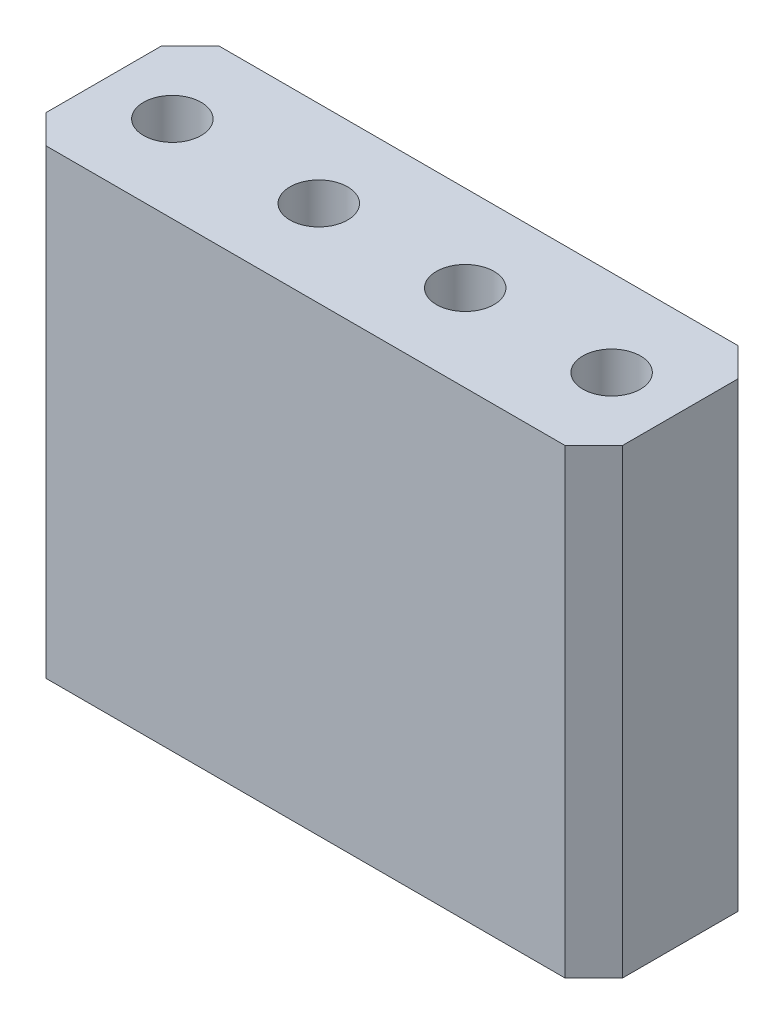
ISO-10303-21;
HEADER;
FILE_DESCRIPTION(('STEP AP214'),'2;1');
FILE_NAME('part.step','',(''),(''),'','','');
FILE_SCHEMA(('AUTOMOTIVE_DESIGN { 1 0 10303 214 1 1 1 1 }'));
ENDSEC;
DATA;
#1=APPLICATION_CONTEXT('core data for automotive mechanical design processes');
#2=APPLICATION_PROTOCOL_DEFINITION('international standard','automotive_design',2000,#1);
#3=PRODUCT_CONTEXT('',#1,'mechanical');
#4=PRODUCT('Part','Part','',(#3));
#5=PRODUCT_RELATED_PRODUCT_CATEGORY('part','',(#4));
#6=PRODUCT_DEFINITION_FORMATION('','',#4);
#7=PRODUCT_DEFINITION_CONTEXT('part definition',#1,'design');
#8=PRODUCT_DEFINITION('design','',#6,#7);
#9=PRODUCT_DEFINITION_SHAPE('','',#8);
#10=(LENGTH_UNIT() NAMED_UNIT(*) SI_UNIT(.MILLI.,.METRE.));
#11=(NAMED_UNIT(*) PLANE_ANGLE_UNIT() SI_UNIT($,.RADIAN.));
#12=(NAMED_UNIT(*) SI_UNIT($,.STERADIAN.) SOLID_ANGLE_UNIT());
#13=UNCERTAINTY_MEASURE_WITH_UNIT(LENGTH_MEASURE(1.E-05),#10,'distance_accuracy_value','');
#14=(GEOMETRIC_REPRESENTATION_CONTEXT(3) GLOBAL_UNCERTAINTY_ASSIGNED_CONTEXT((#13)) GLOBAL_UNIT_ASSIGNED_CONTEXT((#10,
#11,#12)) REPRESENTATION_CONTEXT('',''));
#15=CARTESIAN_POINT('',(0.,0.,0.));
#16=DIRECTION('',(0.,0.,1.));
#17=DIRECTION('',(1.,0.,0.));
#18=AXIS2_PLACEMENT_3D('',#15,#16,#17);
#19=CARTESIAN_POINT('',(0.,6.,0.));
#20=DIRECTION('',(0.,-1.,0.));
#21=DIRECTION('',(0.,0.,-1.));
#22=AXIS2_PLACEMENT_3D('',#19,#20,#21);
#23=PLANE('',#22);
#24=DIRECTION('',(-1.,0.,0.));
#25=VECTOR('',#24,1.);
#26=CARTESIAN_POINT('',(0.949999999999953,6.,-0.319999999999997));
#27=LINE('',#26,#25);
#28=CARTESIAN_POINT('',(1.58999999999995,6.,-0.319999999999997));
#29=VERTEX_POINT('',#28);
#30=CARTESIAN_POINT('',(0.949999999999953,6.,-0.319999999999997));
#31=VERTEX_POINT('',#30);
#32=EDGE_CURVE('E199',#29,#31,#27,.T.);
#33=ORIENTED_EDGE('',*,*,#32,.F.);
#34=DIRECTION('',(0.,0.,-1.));
#35=VECTOR('',#34,1.);
#36=CARTESIAN_POINT('',(1.58999999999995,6.,-0.319999999999997));
#37=LINE('',#36,#35);
#38=CARTESIAN_POINT('',(1.58999999999995,6.,0.320000000000003));
#39=VERTEX_POINT('',#38);
#40=EDGE_CURVE('E225',#39,#29,#37,.T.);
#41=ORIENTED_EDGE('',*,*,#40,.F.);
#42=DIRECTION('',(1.,0.,0.));
#43=VECTOR('',#42,1.);
#44=CARTESIAN_POINT('',(1.58999999999995,6.,0.320000000000003));
#45=LINE('',#44,#43);
#46=CARTESIAN_POINT('',(0.949999999999953,6.,0.320000000000003));
#47=VERTEX_POINT('',#46);
#48=EDGE_CURVE('E223',#47,#39,#45,.T.);
#49=ORIENTED_EDGE('',*,*,#48,.F.);
#50=DIRECTION('',(0.,0.,1.));
#51=VECTOR('',#50,1.);
#52=CARTESIAN_POINT('',(0.949999999999953,6.,-0.319999999999997));
#53=LINE('',#52,#51);
#54=EDGE_CURVE('E209',#31,#47,#53,.T.);
#55=ORIENTED_EDGE('',*,*,#54,.F.);
#56=EDGE_LOOP('',(#33,#41,#49,#55));
#57=FACE_BOUND('',#56,.T.);
#58=CARTESIAN_POINT('',(1.26999999999995,6.,0.));
#59=DIRECTION('',(0.,1.,0.));
#60=DIRECTION('',(0.,0.,1.));
#61=AXIS2_PLACEMENT_3D('',#58,#59,#60);
#62=CIRCLE('',#61,0.5);
#63=CARTESIAN_POINT('',(1.26999999999995,6.,0.500000000000003));
#64=VERTEX_POINT('',#63);
#65=EDGE_CURVE('E423',#64,#64,#62,.T.);
#66=ORIENTED_EDGE('',*,*,#65,.T.);
#67=EDGE_LOOP('',(#66));
#68=FACE_BOUND('',#67,.T.);
#69=ADVANCED_FACE('F35',(#57,#68),#23,.F.);
#70=DIRECTION('',(1.,0.,0.));
#71=VECTOR('',#70,1.);
#72=CARTESIAN_POINT('',(-3.49000000000005,6.,0.320000000000003));
#73=LINE('',#72,#71);
#74=CARTESIAN_POINT('',(-4.13000000000005,6.,0.32000000000001));
#75=VERTEX_POINT('',#74);
#76=CARTESIAN_POINT('',(-3.49000000000005,6.,0.320000000000003));
#77=VERTEX_POINT('',#76);
#78=EDGE_CURVE('E274',#75,#77,#73,.T.);
#79=ORIENTED_EDGE('',*,*,#78,.F.);
#80=DIRECTION('',(0.,0.,1.));
#81=VECTOR('',#80,1.);
#82=CARTESIAN_POINT('',(-4.13000000000005,6.,0.32000000000001));
#83=LINE('',#82,#81);
#84=CARTESIAN_POINT('',(-4.13000000000005,6.,-0.319999999999997));
#85=VERTEX_POINT('',#84);
#86=EDGE_CURVE('E282',#85,#75,#83,.T.);
#87=ORIENTED_EDGE('',*,*,#86,.F.);
#88=DIRECTION('',(-1.,0.,0.));
#89=VECTOR('',#88,1.);
#90=CARTESIAN_POINT('',(-4.13000000000005,6.,-0.319999999999997));
#91=LINE('',#90,#89);
#92=CARTESIAN_POINT('',(-3.49000000000005,6.,-0.319999999999997));
#93=VERTEX_POINT('',#92);
#94=EDGE_CURVE('E279',#93,#85,#91,.T.);
#95=ORIENTED_EDGE('',*,*,#94,.F.);
#96=DIRECTION('',(0.,0.,-1.));
#97=VECTOR('',#96,1.);
#98=CARTESIAN_POINT('',(-3.49000000000005,6.,-0.319999999999997));
#99=LINE('',#98,#97);
#100=EDGE_CURVE('E276',#77,#93,#99,.T.);
#101=ORIENTED_EDGE('',*,*,#100,.F.);
#102=EDGE_LOOP('',(#79,#87,#95,#101));
#103=FACE_BOUND('',#102,.T.);
#104=CARTESIAN_POINT('',(-3.81000000000005,6.,0.));
#105=DIRECTION('',(0.,1.,0.));
#106=DIRECTION('',(0.,0.,1.));
#107=AXIS2_PLACEMENT_3D('',#104,#105,#106);
#108=CIRCLE('',#107,0.5);
#109=CARTESIAN_POINT('',(-3.81000000000005,6.,0.500000000000003));
#110=VERTEX_POINT('',#109);
#111=EDGE_CURVE('E411',#110,#110,#108,.T.);
#112=ORIENTED_EDGE('',*,*,#111,.T.);
#113=EDGE_LOOP('',(#112));
#114=FACE_BOUND('',#113,.T.);
#115=ADVANCED_FACE('F453',(#103,#114),#23,.F.);
#116=DIRECTION('',(-1.,0.,0.));
#117=VECTOR('',#116,1.);
#118=CARTESIAN_POINT('',(-1.59000000000005,6.,-0.319999999999997));
#119=LINE('',#118,#117);
#120=CARTESIAN_POINT('',(-0.950000000000047,6.,-0.319999999999997));
#121=VERTEX_POINT('',#120);
#122=CARTESIAN_POINT('',(-1.59000000000005,6.,-0.319999999999997));
#123=VERTEX_POINT('',#122);
#124=EDGE_CURVE('E243',#121,#123,#119,.T.);
#125=ORIENTED_EDGE('',*,*,#124,.F.);
#126=DIRECTION('',(0.,0.,-1.));
#127=VECTOR('',#126,1.);
#128=CARTESIAN_POINT('',(-0.950000000000047,6.,-0.319999999999997));
#129=LINE('',#128,#127);
#130=CARTESIAN_POINT('',(-0.950000000000047,6.,0.320000000000003));
#131=VERTEX_POINT('',#130);
#132=EDGE_CURVE('E251',#131,#121,#129,.T.);
#133=ORIENTED_EDGE('',*,*,#132,.F.);
#134=DIRECTION('',(1.,0.,0.));
#135=VECTOR('',#134,1.);
#136=CARTESIAN_POINT('',(-1.59000000000005,6.,0.320000000000003));
#137=LINE('',#136,#135);
#138=CARTESIAN_POINT('',(-1.59000000000005,6.,0.320000000000003));
#139=VERTEX_POINT('',#138);
#140=EDGE_CURVE('E248',#139,#131,#137,.T.);
#141=ORIENTED_EDGE('',*,*,#140,.F.);
#142=DIRECTION('',(0.,0.,1.));
#143=VECTOR('',#142,1.);
#144=CARTESIAN_POINT('',(-1.59000000000005,6.,-0.319999999999997));
#145=LINE('',#144,#143);
#146=EDGE_CURVE('E245',#123,#139,#145,.T.);
#147=ORIENTED_EDGE('',*,*,#146,.F.);
#148=EDGE_LOOP('',(#125,#133,#141,#147));
#149=FACE_BOUND('',#148,.T.);
#150=CARTESIAN_POINT('',(-1.27000000000005,6.,0.));
#151=DIRECTION('',(0.,1.,0.));
#152=DIRECTION('',(0.,0.,1.));
#153=AXIS2_PLACEMENT_3D('',#150,#151,#152);
#154=CIRCLE('',#153,0.5);
#155=CARTESIAN_POINT('',(-1.27000000000005,6.,0.500000000000003));
#156=VERTEX_POINT('',#155);
#157=EDGE_CURVE('E417',#156,#156,#154,.T.);
#158=ORIENTED_EDGE('',*,*,#157,.T.);
#159=EDGE_LOOP('',(#158));
#160=FACE_BOUND('',#159,.T.);
#161=ADVANCED_FACE('F459',(#149,#160),#23,.F.);
#162=DIRECTION('',(-1.,0.,0.));
#163=VECTOR('',#162,1.);
#164=CARTESIAN_POINT('',(3.48999999999995,6.,-0.319999999999997));
#165=LINE('',#164,#163);
#166=CARTESIAN_POINT('',(4.12999999999995,6.,-0.319999999999997));
#167=VERTEX_POINT('',#166);
#168=CARTESIAN_POINT('',(3.48999999999995,6.,-0.319999999999997));
#169=VERTEX_POINT('',#168);
#170=EDGE_CURVE('E305',#167,#169,#165,.T.);
#171=ORIENTED_EDGE('',*,*,#170,.F.);
#172=DIRECTION('',(0.,0.,-1.));
#173=VECTOR('',#172,1.);
#174=CARTESIAN_POINT('',(4.12999999999995,6.,0.320000000000004));
#175=LINE('',#174,#173);
#176=CARTESIAN_POINT('',(4.12999999999995,6.,0.320000000000004));
#177=VERTEX_POINT('',#176);
#178=EDGE_CURVE('E313',#177,#167,#175,.T.);
#179=ORIENTED_EDGE('',*,*,#178,.F.);
#180=DIRECTION('',(1.,0.,0.));
#181=VECTOR('',#180,1.);
#182=CARTESIAN_POINT('',(4.12999999999995,6.,0.320000000000004));
#183=LINE('',#182,#181);
#184=CARTESIAN_POINT('',(3.48999999999995,6.,0.320000000000003));
#185=VERTEX_POINT('',#184);
#186=EDGE_CURVE('E310',#185,#177,#183,.T.);
#187=ORIENTED_EDGE('',*,*,#186,.F.);
#188=DIRECTION('',(0.,0.,1.));
#189=VECTOR('',#188,1.);
#190=CARTESIAN_POINT('',(3.48999999999995,6.,-0.319999999999997));
#191=LINE('',#190,#189);
#192=EDGE_CURVE('E307',#169,#185,#191,.T.);
#193=ORIENTED_EDGE('',*,*,#192,.F.);
#194=EDGE_LOOP('',(#171,#179,#187,#193));
#195=FACE_BOUND('',#194,.T.);
#196=CARTESIAN_POINT('',(3.80999999999995,6.,0.));
#197=DIRECTION('',(0.,1.,0.));
#198=DIRECTION('',(0.,0.,1.));
#199=AXIS2_PLACEMENT_3D('',#196,#197,#198);
#200=CIRCLE('',#199,0.5);
#201=CARTESIAN_POINT('',(3.80999999999995,6.,0.500000000000003));
#202=VERTEX_POINT('',#201);
#203=EDGE_CURVE('E429',#202,#202,#200,.T.);
#204=ORIENTED_EDGE('',*,*,#203,.T.);
#205=EDGE_LOOP('',(#204));
#206=FACE_BOUND('',#205,.T.);
#207=ADVANCED_FACE('F455',(#195,#206),#23,.F.);
#208=CARTESIAN_POINT('',(0.,0.,0.));
#209=DIRECTION('',(0.,-1.,0.));
#210=DIRECTION('',(0.,0.,-1.));
#211=AXIS2_PLACEMENT_3D('',#208,#209,#210);
#212=PLANE('',#211);
#213=DIRECTION('',(0.,0.,-1.));
#214=VECTOR('',#213,1.);
#215=CARTESIAN_POINT('',(5.,0.,1.5));
#216=LINE('',#215,#214);
#217=CARTESIAN_POINT('',(5.,0.,1.));
#218=VERTEX_POINT('',#217);
#219=CARTESIAN_POINT('',(5.,0.,-0.999999999999999));
#220=VERTEX_POINT('',#219);
#221=EDGE_CURVE('E335',#218,#220,#216,.T.);
#222=ORIENTED_EDGE('',*,*,#221,.F.);
#223=DIRECTION('',(0.707106781186551,0.,-0.707106781186544));
#224=VECTOR('',#223,1.);
#225=CARTESIAN_POINT('',(2.99999999999998,0.,3.00000000000001));
#226=LINE('',#225,#224);
#227=CARTESIAN_POINT('',(4.5,0.,1.5));
#228=VERTEX_POINT('',#227);
#229=EDGE_CURVE('E357',#218,#228,#226,.F.);
#230=ORIENTED_EDGE('',*,*,#229,.T.);
#231=DIRECTION('',(1.,0.,0.));
#232=VECTOR('',#231,1.);
#233=CARTESIAN_POINT('',(-5.,0.,1.5));
#234=LINE('',#233,#232);
#235=CARTESIAN_POINT('',(-4.5,0.,1.5));
#236=VERTEX_POINT('',#235);
#237=EDGE_CURVE('E343',#236,#228,#234,.T.);
#238=ORIENTED_EDGE('',*,*,#237,.F.);
#239=DIRECTION('',(0.707106781186548,0.,0.707106781186548));
#240=VECTOR('',#239,1.);
#241=CARTESIAN_POINT('',(-3.,0.,3.));
#242=LINE('',#241,#240);
#243=CARTESIAN_POINT('',(-5.,0.,1.));
#244=VERTEX_POINT('',#243);
#245=EDGE_CURVE('E355',#236,#244,#242,.F.);
#246=ORIENTED_EDGE('',*,*,#245,.T.);
#247=DIRECTION('',(0.,0.,1.));
#248=VECTOR('',#247,1.);
#249=CARTESIAN_POINT('',(-5.,0.,1.5));
#250=LINE('',#249,#248);
#251=CARTESIAN_POINT('',(-5.,0.,-1.));
#252=VERTEX_POINT('',#251);
#253=EDGE_CURVE('E341',#252,#244,#250,.T.);
#254=ORIENTED_EDGE('',*,*,#253,.F.);
#255=DIRECTION('',(-0.70710678118655,0.,0.707106781186545));
#256=VECTOR('',#255,1.);
#257=CARTESIAN_POINT('',(-2.99999999999998,0.,-3.));
#258=LINE('',#257,#256);
#259=CARTESIAN_POINT('',(-4.5,0.,-1.5));
#260=VERTEX_POINT('',#259);
#261=EDGE_CURVE('E351',#252,#260,#258,.F.);
#262=ORIENTED_EDGE('',*,*,#261,.T.);
#263=DIRECTION('',(-1.,0.,0.));
#264=VECTOR('',#263,1.);
#265=CARTESIAN_POINT('',(-5.,0.,-1.5));
#266=LINE('',#265,#264);
#267=CARTESIAN_POINT('',(4.5,0.,-1.5));
#268=VERTEX_POINT('',#267);
#269=EDGE_CURVE('E338',#268,#260,#266,.T.);
#270=ORIENTED_EDGE('',*,*,#269,.F.);
#271=DIRECTION('',(-0.707106781186546,0.,-0.707106781186549));
#272=VECTOR('',#271,1.);
#273=CARTESIAN_POINT('',(3.00000000000001,0.,-3.));
#274=LINE('',#273,#272);
#275=EDGE_CURVE('E353',#268,#220,#274,.F.);
#276=ORIENTED_EDGE('',*,*,#275,.T.);
#277=EDGE_LOOP('',(#222,#230,#238,#246,#254,#262,#270,#276));
#278=FACE_BOUND('',#277,.T.);
#279=DIRECTION('',(0.,0.,-1.));
#280=VECTOR('',#279,1.);
#281=CARTESIAN_POINT('',(4.12999999999995,0.,0.320000000000004));
#282=LINE('',#281,#280);
#283=CARTESIAN_POINT('',(4.12999999999995,0.,0.320000000000004));
#284=VERTEX_POINT('',#283);
#285=CARTESIAN_POINT('',(4.12999999999995,0.,-0.319999999999997));
#286=VERTEX_POINT('',#285);
#287=EDGE_CURVE('E308',#284,#286,#282,.T.);
#288=ORIENTED_EDGE('',*,*,#287,.T.);
#289=DIRECTION('',(-1.,0.,0.));
#290=VECTOR('',#289,1.);
#291=CARTESIAN_POINT('',(3.48999999999995,0.,-0.319999999999997));
#292=LINE('',#291,#290);
#293=CARTESIAN_POINT('',(3.48999999999995,0.,-0.319999999999997));
#294=VERTEX_POINT('',#293);
#295=EDGE_CURVE('E304',#286,#294,#292,.T.);
#296=ORIENTED_EDGE('',*,*,#295,.T.);
#297=DIRECTION('',(0.,0.,1.));
#298=VECTOR('',#297,1.);
#299=CARTESIAN_POINT('',(3.48999999999995,0.,-0.319999999999997));
#300=LINE('',#299,#298);
#301=CARTESIAN_POINT('',(3.48999999999995,0.,0.320000000000003));
#302=VERTEX_POINT('',#301);
#303=EDGE_CURVE('E318',#294,#302,#300,.T.);
#304=ORIENTED_EDGE('',*,*,#303,.T.);
#305=DIRECTION('',(1.,0.,0.));
#306=VECTOR('',#305,1.);
#307=CARTESIAN_POINT('',(4.12999999999995,0.,0.320000000000004));
#308=LINE('',#307,#306);
#309=EDGE_CURVE('E321',#302,#284,#308,.T.);
#310=ORIENTED_EDGE('',*,*,#309,.T.);
#311=EDGE_LOOP('',(#288,#296,#304,#310));
#312=FACE_BOUND('',#311,.T.);
#313=DIRECTION('',(0.,0.,1.));
#314=VECTOR('',#313,1.);
#315=CARTESIAN_POINT('',(-4.13000000000005,0.,0.32000000000001));
#316=LINE('',#315,#314);
#317=CARTESIAN_POINT('',(-4.13000000000005,0.,-0.319999999999997));
#318=VERTEX_POINT('',#317);
#319=CARTESIAN_POINT('',(-4.13000000000005,0.,0.32000000000001));
#320=VERTEX_POINT('',#319);
#321=EDGE_CURVE('E277',#318,#320,#316,.T.);
#322=ORIENTED_EDGE('',*,*,#321,.T.);
#323=DIRECTION('',(1.,0.,0.));
#324=VECTOR('',#323,1.);
#325=CARTESIAN_POINT('',(-3.49000000000005,0.,0.320000000000003));
#326=LINE('',#325,#324);
#327=CARTESIAN_POINT('',(-3.49000000000005,0.,0.320000000000003));
#328=VERTEX_POINT('',#327);
#329=EDGE_CURVE('E273',#320,#328,#326,.T.);
#330=ORIENTED_EDGE('',*,*,#329,.T.);
#331=DIRECTION('',(0.,0.,-1.));
#332=VECTOR('',#331,1.);
#333=CARTESIAN_POINT('',(-3.49000000000005,0.,-0.319999999999997));
#334=LINE('',#333,#332);
#335=CARTESIAN_POINT('',(-3.49000000000005,0.,-0.319999999999997));
#336=VERTEX_POINT('',#335);
#337=EDGE_CURVE('E287',#328,#336,#334,.T.);
#338=ORIENTED_EDGE('',*,*,#337,.T.);
#339=DIRECTION('',(-1.,0.,0.));
#340=VECTOR('',#339,1.);
#341=CARTESIAN_POINT('',(-4.13000000000005,0.,-0.319999999999997));
#342=LINE('',#341,#340);
#343=EDGE_CURVE('E290',#336,#318,#342,.T.);
#344=ORIENTED_EDGE('',*,*,#343,.T.);
#345=EDGE_LOOP('',(#322,#330,#338,#344));
#346=FACE_BOUND('',#345,.T.);
#347=DIRECTION('',(0.,0.,-1.));
#348=VECTOR('',#347,1.);
#349=CARTESIAN_POINT('',(-0.950000000000047,0.,-0.319999999999997));
#350=LINE('',#349,#348);
#351=CARTESIAN_POINT('',(-0.950000000000047,0.,0.320000000000003));
#352=VERTEX_POINT('',#351);
#353=CARTESIAN_POINT('',(-0.950000000000047,0.,-0.319999999999997));
#354=VERTEX_POINT('',#353);
#355=EDGE_CURVE('E246',#352,#354,#350,.T.);
#356=ORIENTED_EDGE('',*,*,#355,.T.);
#357=DIRECTION('',(-1.,0.,0.));
#358=VECTOR('',#357,1.);
#359=CARTESIAN_POINT('',(-1.59000000000005,0.,-0.319999999999997));
#360=LINE('',#359,#358);
#361=CARTESIAN_POINT('',(-1.59000000000005,0.,-0.319999999999997));
#362=VERTEX_POINT('',#361);
#363=EDGE_CURVE('E217',#354,#362,#360,.T.);
#364=ORIENTED_EDGE('',*,*,#363,.T.);
#365=DIRECTION('',(0.,0.,1.));
#366=VECTOR('',#365,1.);
#367=CARTESIAN_POINT('',(-1.59000000000005,0.,-0.319999999999997));
#368=LINE('',#367,#366);
#369=CARTESIAN_POINT('',(-1.59000000000005,0.,0.320000000000003));
#370=VERTEX_POINT('',#369);
#371=EDGE_CURVE('E256',#362,#370,#368,.T.);
#372=ORIENTED_EDGE('',*,*,#371,.T.);
#373=DIRECTION('',(1.,0.,0.));
#374=VECTOR('',#373,1.);
#375=CARTESIAN_POINT('',(-1.59000000000005,0.,0.320000000000003));
#376=LINE('',#375,#374);
#377=EDGE_CURVE('E259',#370,#352,#376,.T.);
#378=ORIENTED_EDGE('',*,*,#377,.T.);
#379=EDGE_LOOP('',(#356,#364,#372,#378));
#380=FACE_BOUND('',#379,.T.);
#381=DIRECTION('',(0.,0.,-1.));
#382=VECTOR('',#381,1.);
#383=CARTESIAN_POINT('',(1.58999999999995,0.,-0.319999999999997));
#384=LINE('',#383,#382);
#385=CARTESIAN_POINT('',(1.58999999999995,0.,0.320000000000003));
#386=VERTEX_POINT('',#385);
#387=CARTESIAN_POINT('',(1.58999999999995,0.,-0.319999999999997));
#388=VERTEX_POINT('',#387);
#389=EDGE_CURVE('E210',#386,#388,#384,.T.);
#390=ORIENTED_EDGE('',*,*,#389,.T.);
#391=DIRECTION('',(-1.,0.,0.));
#392=VECTOR('',#391,1.);
#393=CARTESIAN_POINT('',(0.949999999999953,0.,-0.319999999999997));
#394=LINE('',#393,#392);
#395=CARTESIAN_POINT('',(0.949999999999953,0.,-0.319999999999997));
#396=VERTEX_POINT('',#395);
#397=EDGE_CURVE('E230',#388,#396,#394,.T.);
#398=ORIENTED_EDGE('',*,*,#397,.T.);
#399=DIRECTION('',(0.,0.,1.));
#400=VECTOR('',#399,1.);
#401=CARTESIAN_POINT('',(0.949999999999953,0.,-0.319999999999997));
#402=LINE('',#401,#400);
#403=CARTESIAN_POINT('',(0.949999999999953,0.,0.320000000000003));
#404=VERTEX_POINT('',#403);
#405=EDGE_CURVE('E216',#396,#404,#402,.T.);
#406=ORIENTED_EDGE('',*,*,#405,.T.);
#407=DIRECTION('',(1.,0.,0.));
#408=VECTOR('',#407,1.);
#409=CARTESIAN_POINT('',(1.58999999999995,0.,0.320000000000003));
#410=LINE('',#409,#408);
#411=EDGE_CURVE('E234',#404,#386,#410,.T.);
#412=ORIENTED_EDGE('',*,*,#411,.T.);
#413=EDGE_LOOP('',(#390,#398,#406,#412));
#414=FACE_BOUND('',#413,.T.);
#415=ADVANCED_FACE('F395',(#278,#312,#346,#380,#414),#212,.T.);
#416=CARTESIAN_POINT('',(5.,6.,1.5));
#417=DIRECTION('',(-1.,0.,0.));
#418=DIRECTION('',(0.,0.,1.));
#419=AXIS2_PLACEMENT_3D('',#416,#417,#418);
#420=PLANE('',#419);
#421=DIRECTION('',(0.,0.,-1.));
#422=VECTOR('',#421,1.);
#423=CARTESIAN_POINT('',(5.,8.,1.5));
#424=LINE('',#423,#422);
#425=CARTESIAN_POINT('',(5.,8.,1.));
#426=VERTEX_POINT('',#425);
#427=CARTESIAN_POINT('',(5.,8.,-1.));
#428=VERTEX_POINT('',#427);
#429=EDGE_CURVE('E388',#426,#428,#424,.T.);
#430=ORIENTED_EDGE('',*,*,#429,.F.);
#431=DIRECTION('',(0.,-1.,0.));
#432=VECTOR('',#431,1.);
#433=CARTESIAN_POINT('',(5.,6.,1.));
#434=LINE('',#433,#432);
#435=EDGE_CURVE('E348',#426,#218,#434,.T.);
#436=ORIENTED_EDGE('',*,*,#435,.T.);
#437=ORIENTED_EDGE('',*,*,#221,.T.);
#438=DIRECTION('',(0.,1.,0.));
#439=VECTOR('',#438,1.);
#440=CARTESIAN_POINT('',(5.,6.,-0.999999999999999));
#441=LINE('',#440,#439);
#442=EDGE_CURVE('E346',#220,#428,#441,.T.);
#443=ORIENTED_EDGE('',*,*,#442,.T.);
#444=EDGE_LOOP('',(#430,#436,#437,#443));
#445=FACE_BOUND('',#444,.T.);
#446=ADVANCED_FACE('F469',(#445),#420,.F.);
#447=CARTESIAN_POINT('',(-5.,6.,-1.5));
#448=DIRECTION('',(0.,0.,1.));
#449=DIRECTION('',(1.,0.,0.));
#450=AXIS2_PLACEMENT_3D('',#447,#448,#449);
#451=PLANE('',#450);
#452=DIRECTION('',(-1.,0.,0.));
#453=VECTOR('',#452,1.);
#454=CARTESIAN_POINT('',(-5.,8.,-1.5));
#455=LINE('',#454,#453);
#456=CARTESIAN_POINT('',(4.5,8.,-1.5));
#457=VERTEX_POINT('',#456);
#458=CARTESIAN_POINT('',(-4.5,8.,-1.5));
#459=VERTEX_POINT('',#458);
#460=EDGE_CURVE('E378',#457,#459,#455,.T.);
#461=ORIENTED_EDGE('',*,*,#460,.F.);
#462=DIRECTION('',(0.,-1.,0.));
#463=VECTOR('',#462,1.);
#464=CARTESIAN_POINT('',(4.5,6.,-1.5));
#465=LINE('',#464,#463);
#466=EDGE_CURVE('E11',#457,#268,#465,.T.);
#467=ORIENTED_EDGE('',*,*,#466,.T.);
#468=ORIENTED_EDGE('',*,*,#269,.T.);
#469=DIRECTION('',(0.,1.,0.));
#470=VECTOR('',#469,1.);
#471=CARTESIAN_POINT('',(-4.5,6.,-1.5));
#472=LINE('',#471,#470);
#473=EDGE_CURVE('E43',#260,#459,#472,.T.);
#474=ORIENTED_EDGE('',*,*,#473,.T.);
#475=EDGE_LOOP('',(#461,#467,#468,#474));
#476=FACE_BOUND('',#475,.T.);
#477=ADVANCED_FACE('F377',(#476),#451,.F.);
#478=CARTESIAN_POINT('',(-5.,6.,1.5));
#479=DIRECTION('',(1.,0.,0.));
#480=DIRECTION('',(0.,0.,-1.));
#481=AXIS2_PLACEMENT_3D('',#478,#479,#480);
#482=PLANE('',#481);
#483=ORIENTED_EDGE('',*,*,#253,.T.);
#484=DIRECTION('',(0.,1.,0.));
#485=VECTOR('',#484,1.);
#486=CARTESIAN_POINT('',(-5.,6.,1.));
#487=LINE('',#486,#485);
#488=CARTESIAN_POINT('',(-5.,8.,1.));
#489=VERTEX_POINT('',#488);
#490=EDGE_CURVE('E50',#244,#489,#487,.T.);
#491=ORIENTED_EDGE('',*,*,#490,.T.);
#492=DIRECTION('',(0.,0.,1.));
#493=VECTOR('',#492,1.);
#494=CARTESIAN_POINT('',(-5.,8.,1.5));
#495=LINE('',#494,#493);
#496=CARTESIAN_POINT('',(-5.,8.,-1.));
#497=VERTEX_POINT('',#496);
#498=EDGE_CURVE('E387',#497,#489,#495,.T.);
#499=ORIENTED_EDGE('',*,*,#498,.F.);
#500=DIRECTION('',(0.,-1.,0.));
#501=VECTOR('',#500,1.);
#502=CARTESIAN_POINT('',(-5.,6.,-1.));
#503=LINE('',#502,#501);
#504=EDGE_CURVE('E371',#497,#252,#503,.T.);
#505=ORIENTED_EDGE('',*,*,#504,.T.);
#506=EDGE_LOOP('',(#483,#491,#499,#505));
#507=FACE_BOUND('',#506,.T.);
#508=ADVANCED_FACE('F392',(#507),#482,.F.);
#509=CARTESIAN_POINT('',(-5.,6.,1.5));
#510=DIRECTION('',(0.,0.,-1.));
#511=DIRECTION('',(-1.,0.,0.));
#512=AXIS2_PLACEMENT_3D('',#509,#510,#511);
#513=PLANE('',#512);
#514=ORIENTED_EDGE('',*,*,#237,.T.);
#515=DIRECTION('',(0.,1.,0.));
#516=VECTOR('',#515,1.);
#517=CARTESIAN_POINT('',(4.5,6.,1.5));
#518=LINE('',#517,#516);
#519=CARTESIAN_POINT('',(4.5,8.,1.5));
#520=VERTEX_POINT('',#519);
#521=EDGE_CURVE('E362',#228,#520,#518,.T.);
#522=ORIENTED_EDGE('',*,*,#521,.T.);
#523=DIRECTION('',(1.,0.,0.));
#524=VECTOR('',#523,1.);
#525=CARTESIAN_POINT('',(-5.,8.,1.5));
#526=LINE('',#525,#524);
#527=CARTESIAN_POINT('',(-4.5,8.,1.5));
#528=VERTEX_POINT('',#527);
#529=EDGE_CURVE('E232',#528,#520,#526,.T.);
#530=ORIENTED_EDGE('',*,*,#529,.F.);
#531=DIRECTION('',(0.,-1.,0.));
#532=VECTOR('',#531,1.);
#533=CARTESIAN_POINT('',(-4.5,6.,1.5));
#534=LINE('',#533,#532);
#535=EDGE_CURVE('E359',#528,#236,#534,.T.);
#536=ORIENTED_EDGE('',*,*,#535,.T.);
#537=EDGE_LOOP('',(#514,#522,#530,#536));
#538=FACE_BOUND('',#537,.T.);
#539=ADVANCED_FACE('F404',(#538),#513,.F.);
#540=CARTESIAN_POINT('',(3.48999999999995,6.,-0.319999999999997));
#541=DIRECTION('',(0.,0.,1.));
#542=DIRECTION('',(1.,0.,0.));
#543=AXIS2_PLACEMENT_3D('',#540,#541,#542);
#544=PLANE('',#543);
#545=ORIENTED_EDGE('',*,*,#295,.F.);
#546=DIRECTION('',(0.,-1.,0.));
#547=VECTOR('',#546,1.);
#548=CARTESIAN_POINT('',(4.12999999999995,6.,-0.319999999999997));
#549=LINE('',#548,#547);
#550=EDGE_CURVE('E315',#167,#286,#549,.T.);
#551=ORIENTED_EDGE('',*,*,#550,.F.);
#552=ORIENTED_EDGE('',*,*,#170,.T.);
#553=DIRECTION('',(0.,-1.,0.));
#554=VECTOR('',#553,1.);
#555=CARTESIAN_POINT('',(3.48999999999995,6.,-0.319999999999997));
#556=LINE('',#555,#554);
#557=EDGE_CURVE('E332',#169,#294,#556,.T.);
#558=ORIENTED_EDGE('',*,*,#557,.T.);
#559=EDGE_LOOP('',(#545,#551,#552,#558));
#560=FACE_BOUND('',#559,.T.);
#561=ADVANCED_FACE('F556',(#560),#544,.T.);
#562=CARTESIAN_POINT('',(3.48999999999995,6.,-0.319999999999997));
#563=DIRECTION('',(1.,0.,0.));
#564=DIRECTION('',(0.,0.,-1.));
#565=AXIS2_PLACEMENT_3D('',#562,#563,#564);
#566=PLANE('',#565);
#567=ORIENTED_EDGE('',*,*,#303,.F.);
#568=ORIENTED_EDGE('',*,*,#557,.F.);
#569=ORIENTED_EDGE('',*,*,#192,.T.);
#570=DIRECTION('',(0.,-1.,0.));
#571=VECTOR('',#570,1.);
#572=CARTESIAN_POINT('',(3.48999999999995,6.,0.320000000000003));
#573=LINE('',#572,#571);
#574=EDGE_CURVE('E330',#185,#302,#573,.T.);
#575=ORIENTED_EDGE('',*,*,#574,.T.);
#576=EDGE_LOOP('',(#567,#568,#569,#575));
#577=FACE_BOUND('',#576,.T.);
#578=ADVANCED_FACE('F751',(#577),#566,.T.);
#579=CARTESIAN_POINT('',(4.12999999999995,6.,0.320000000000004));
#580=DIRECTION('',(0.,0.,-1.));
#581=DIRECTION('',(-1.,0.,0.));
#582=AXIS2_PLACEMENT_3D('',#579,#580,#581);
#583=PLANE('',#582);
#584=ORIENTED_EDGE('',*,*,#309,.F.);
#585=ORIENTED_EDGE('',*,*,#574,.F.);
#586=ORIENTED_EDGE('',*,*,#186,.T.);
#587=DIRECTION('',(0.,-1.,0.));
#588=VECTOR('',#587,1.);
#589=CARTESIAN_POINT('',(4.12999999999995,6.,0.320000000000004));
#590=LINE('',#589,#588);
#591=EDGE_CURVE('E328',#177,#284,#590,.T.);
#592=ORIENTED_EDGE('',*,*,#591,.T.);
#593=EDGE_LOOP('',(#584,#585,#586,#592));
#594=FACE_BOUND('',#593,.T.);
#595=ADVANCED_FACE('F741',(#594),#583,.T.);
#596=CARTESIAN_POINT('',(4.12999999999995,6.,0.320000000000004));
#597=DIRECTION('',(-1.,0.,0.));
#598=DIRECTION('',(0.,0.,1.));
#599=AXIS2_PLACEMENT_3D('',#596,#597,#598);
#600=PLANE('',#599);
#601=ORIENTED_EDGE('',*,*,#287,.F.);
#602=ORIENTED_EDGE('',*,*,#591,.F.);
#603=ORIENTED_EDGE('',*,*,#178,.T.);
#604=ORIENTED_EDGE('',*,*,#550,.T.);
#605=EDGE_LOOP('',(#601,#602,#603,#604));
#606=FACE_BOUND('',#605,.T.);
#607=ADVANCED_FACE('F731',(#606),#600,.T.);
#608=CARTESIAN_POINT('',(-3.49000000000005,6.,0.320000000000003));
#609=DIRECTION('',(0.,0.,-1.));
#610=DIRECTION('',(-1.,0.,0.));
#611=AXIS2_PLACEMENT_3D('',#608,#609,#610);
#612=PLANE('',#611);
#613=ORIENTED_EDGE('',*,*,#329,.F.);
#614=DIRECTION('',(0.,-1.,0.));
#615=VECTOR('',#614,1.);
#616=CARTESIAN_POINT('',(-4.13000000000005,6.,0.32000000000001));
#617=LINE('',#616,#615);
#618=EDGE_CURVE('E284',#75,#320,#617,.T.);
#619=ORIENTED_EDGE('',*,*,#618,.F.);
#620=ORIENTED_EDGE('',*,*,#78,.T.);
#621=DIRECTION('',(0.,-1.,0.));
#622=VECTOR('',#621,1.);
#623=CARTESIAN_POINT('',(-3.49000000000005,6.,0.320000000000003));
#624=LINE('',#623,#622);
#625=EDGE_CURVE('E301',#77,#328,#624,.T.);
#626=ORIENTED_EDGE('',*,*,#625,.T.);
#627=EDGE_LOOP('',(#613,#619,#620,#626));
#628=FACE_BOUND('',#627,.T.);
#629=ADVANCED_FACE('F721',(#628),#612,.T.);
#630=CARTESIAN_POINT('',(-3.49000000000005,6.,-0.319999999999997));
#631=DIRECTION('',(-1.,0.,0.));
#632=DIRECTION('',(0.,0.,1.));
#633=AXIS2_PLACEMENT_3D('',#630,#631,#632);
#634=PLANE('',#633);
#635=ORIENTED_EDGE('',*,*,#337,.F.);
#636=ORIENTED_EDGE('',*,*,#625,.F.);
#637=ORIENTED_EDGE('',*,*,#100,.T.);
#638=DIRECTION('',(0.,-1.,0.));
#639=VECTOR('',#638,1.);
#640=CARTESIAN_POINT('',(-3.49000000000005,6.,-0.319999999999997));
#641=LINE('',#640,#639);
#642=EDGE_CURVE('E299',#93,#336,#641,.T.);
#643=ORIENTED_EDGE('',*,*,#642,.T.);
#644=EDGE_LOOP('',(#635,#636,#637,#643));
#645=FACE_BOUND('',#644,.T.);
#646=ADVANCED_FACE('F711',(#645),#634,.T.);
#647=CARTESIAN_POINT('',(-4.13000000000005,6.,-0.319999999999997));
#648=DIRECTION('',(0.,0.,1.));
#649=DIRECTION('',(1.,0.,0.));
#650=AXIS2_PLACEMENT_3D('',#647,#648,#649);
#651=PLANE('',#650);
#652=ORIENTED_EDGE('',*,*,#343,.F.);
#653=ORIENTED_EDGE('',*,*,#642,.F.);
#654=ORIENTED_EDGE('',*,*,#94,.T.);
#655=DIRECTION('',(0.,-1.,0.));
#656=VECTOR('',#655,1.);
#657=CARTESIAN_POINT('',(-4.13000000000005,6.,-0.319999999999997));
#658=LINE('',#657,#656);
#659=EDGE_CURVE('E297',#85,#318,#658,.T.);
#660=ORIENTED_EDGE('',*,*,#659,.T.);
#661=EDGE_LOOP('',(#652,#653,#654,#660));
#662=FACE_BOUND('',#661,.T.);
#663=ADVANCED_FACE('F701',(#662),#651,.T.);
#664=CARTESIAN_POINT('',(-4.13000000000005,6.,0.32000000000001));
#665=DIRECTION('',(1.,0.,0.));
#666=DIRECTION('',(0.,0.,-1.));
#667=AXIS2_PLACEMENT_3D('',#664,#665,#666);
#668=PLANE('',#667);
#669=ORIENTED_EDGE('',*,*,#321,.F.);
#670=ORIENTED_EDGE('',*,*,#659,.F.);
#671=ORIENTED_EDGE('',*,*,#86,.T.);
#672=ORIENTED_EDGE('',*,*,#618,.T.);
#673=EDGE_LOOP('',(#669,#670,#671,#672));
#674=FACE_BOUND('',#673,.T.);
#675=ADVANCED_FACE('F691',(#674),#668,.T.);
#676=CARTESIAN_POINT('',(-1.59000000000005,6.,-0.319999999999997));
#677=DIRECTION('',(0.,0.,1.));
#678=DIRECTION('',(1.,0.,0.));
#679=AXIS2_PLACEMENT_3D('',#676,#677,#678);
#680=PLANE('',#679);
#681=ORIENTED_EDGE('',*,*,#363,.F.);
#682=DIRECTION('',(0.,-1.,0.));
#683=VECTOR('',#682,1.);
#684=CARTESIAN_POINT('',(-0.950000000000047,6.,-0.319999999999997));
#685=LINE('',#684,#683);
#686=EDGE_CURVE('E253',#121,#354,#685,.T.);
#687=ORIENTED_EDGE('',*,*,#686,.F.);
#688=ORIENTED_EDGE('',*,*,#124,.T.);
#689=DIRECTION('',(0.,-1.,0.));
#690=VECTOR('',#689,1.);
#691=CARTESIAN_POINT('',(-1.59000000000005,6.,-0.319999999999997));
#692=LINE('',#691,#690);
#693=EDGE_CURVE('E270',#123,#362,#692,.T.);
#694=ORIENTED_EDGE('',*,*,#693,.T.);
#695=EDGE_LOOP('',(#681,#687,#688,#694));
#696=FACE_BOUND('',#695,.T.);
#697=ADVANCED_FACE('F681',(#696),#680,.T.);
#698=CARTESIAN_POINT('',(-1.59000000000005,6.,-0.319999999999997));
#699=DIRECTION('',(1.,0.,0.));
#700=DIRECTION('',(0.,0.,-1.));
#701=AXIS2_PLACEMENT_3D('',#698,#699,#700);
#702=PLANE('',#701);
#703=ORIENTED_EDGE('',*,*,#371,.F.);
#704=ORIENTED_EDGE('',*,*,#693,.F.);
#705=ORIENTED_EDGE('',*,*,#146,.T.);
#706=DIRECTION('',(0.,-1.,0.));
#707=VECTOR('',#706,1.);
#708=CARTESIAN_POINT('',(-1.59000000000005,6.,0.320000000000003));
#709=LINE('',#708,#707);
#710=EDGE_CURVE('E268',#139,#370,#709,.T.);
#711=ORIENTED_EDGE('',*,*,#710,.T.);
#712=EDGE_LOOP('',(#703,#704,#705,#711));
#713=FACE_BOUND('',#712,.T.);
#714=ADVANCED_FACE('F671',(#713),#702,.T.);
#715=CARTESIAN_POINT('',(-1.59000000000005,6.,0.320000000000003));
#716=DIRECTION('',(0.,0.,-1.));
#717=DIRECTION('',(-1.,0.,0.));
#718=AXIS2_PLACEMENT_3D('',#715,#716,#717);
#719=PLANE('',#718);
#720=ORIENTED_EDGE('',*,*,#377,.F.);
#721=ORIENTED_EDGE('',*,*,#710,.F.);
#722=ORIENTED_EDGE('',*,*,#140,.T.);
#723=DIRECTION('',(0.,-1.,0.));
#724=VECTOR('',#723,1.);
#725=CARTESIAN_POINT('',(-0.950000000000047,6.,0.320000000000003));
#726=LINE('',#725,#724);
#727=EDGE_CURVE('E266',#131,#352,#726,.T.);
#728=ORIENTED_EDGE('',*,*,#727,.T.);
#729=EDGE_LOOP('',(#720,#721,#722,#728));
#730=FACE_BOUND('',#729,.T.);
#731=ADVANCED_FACE('F661',(#730),#719,.T.);
#732=CARTESIAN_POINT('',(-0.950000000000047,6.,-0.319999999999997));
#733=DIRECTION('',(-1.,0.,0.));
#734=DIRECTION('',(0.,0.,1.));
#735=AXIS2_PLACEMENT_3D('',#732,#733,#734);
#736=PLANE('',#735);
#737=ORIENTED_EDGE('',*,*,#355,.F.);
#738=ORIENTED_EDGE('',*,*,#727,.F.);
#739=ORIENTED_EDGE('',*,*,#132,.T.);
#740=ORIENTED_EDGE('',*,*,#686,.T.);
#741=EDGE_LOOP('',(#737,#738,#739,#740));
#742=FACE_BOUND('',#741,.T.);
#743=ADVANCED_FACE('F652',(#742),#736,.T.);
#744=CARTESIAN_POINT('',(0.949999999999953,6.,-0.319999999999997));
#745=DIRECTION('',(0.,0.,1.));
#746=DIRECTION('',(1.,0.,0.));
#747=AXIS2_PLACEMENT_3D('',#744,#745,#746);
#748=PLANE('',#747);
#749=ORIENTED_EDGE('',*,*,#397,.F.);
#750=DIRECTION('',(0.,-1.,0.));
#751=VECTOR('',#750,1.);
#752=CARTESIAN_POINT('',(1.58999999999995,6.,-0.319999999999997));
#753=LINE('',#752,#751);
#754=EDGE_CURVE('E205',#29,#388,#753,.T.);
#755=ORIENTED_EDGE('',*,*,#754,.F.);
#756=ORIENTED_EDGE('',*,*,#32,.T.);
#757=DIRECTION('',(0.,-1.,0.));
#758=VECTOR('',#757,1.);
#759=CARTESIAN_POINT('',(0.949999999999953,6.,-0.319999999999997));
#760=LINE('',#759,#758);
#761=EDGE_CURVE('E202',#31,#396,#760,.T.);
#762=ORIENTED_EDGE('',*,*,#761,.T.);
#763=EDGE_LOOP('',(#749,#755,#756,#762));
#764=FACE_BOUND('',#763,.T.);
#765=ADVANCED_FACE('F201',(#764),#748,.T.);
#766=CARTESIAN_POINT('',(0.949999999999953,6.,-0.319999999999997));
#767=DIRECTION('',(1.,0.,0.));
#768=DIRECTION('',(0.,0.,-1.));
#769=AXIS2_PLACEMENT_3D('',#766,#767,#768);
#770=PLANE('',#769);
#771=ORIENTED_EDGE('',*,*,#405,.F.);
#772=ORIENTED_EDGE('',*,*,#761,.F.);
#773=ORIENTED_EDGE('',*,*,#54,.T.);
#774=DIRECTION('',(0.,-1.,0.));
#775=VECTOR('',#774,1.);
#776=CARTESIAN_POINT('',(0.949999999999953,6.,0.320000000000003));
#777=LINE('',#776,#775);
#778=EDGE_CURVE('E218',#47,#404,#777,.T.);
#779=ORIENTED_EDGE('',*,*,#778,.T.);
#780=EDGE_LOOP('',(#771,#772,#773,#779));
#781=FACE_BOUND('',#780,.T.);
#782=ADVANCED_FACE('F213',(#781),#770,.T.);
#783=CARTESIAN_POINT('',(1.58999999999995,6.,0.320000000000003));
#784=DIRECTION('',(0.,0.,-1.));
#785=DIRECTION('',(-1.,0.,0.));
#786=AXIS2_PLACEMENT_3D('',#783,#784,#785);
#787=PLANE('',#786);
#788=ORIENTED_EDGE('',*,*,#411,.F.);
#789=ORIENTED_EDGE('',*,*,#778,.F.);
#790=ORIENTED_EDGE('',*,*,#48,.T.);
#791=DIRECTION('',(0.,-1.,0.));
#792=VECTOR('',#791,1.);
#793=CARTESIAN_POINT('',(1.58999999999995,6.,0.320000000000003));
#794=LINE('',#793,#792);
#795=EDGE_CURVE('E240',#39,#386,#794,.T.);
#796=ORIENTED_EDGE('',*,*,#795,.T.);
#797=EDGE_LOOP('',(#788,#789,#790,#796));
#798=FACE_BOUND('',#797,.T.);
#799=ADVANCED_FACE('F449',(#798),#787,.T.);
#800=CARTESIAN_POINT('',(1.58999999999995,6.,-0.319999999999997));
#801=DIRECTION('',(-1.,0.,0.));
#802=DIRECTION('',(0.,0.,1.));
#803=AXIS2_PLACEMENT_3D('',#800,#801,#802);
#804=PLANE('',#803);
#805=ORIENTED_EDGE('',*,*,#389,.F.);
#806=ORIENTED_EDGE('',*,*,#795,.F.);
#807=ORIENTED_EDGE('',*,*,#40,.T.);
#808=ORIENTED_EDGE('',*,*,#754,.T.);
#809=EDGE_LOOP('',(#805,#806,#807,#808));
#810=FACE_BOUND('',#809,.T.);
#811=ADVANCED_FACE('F440',(#810),#804,.T.);
#812=CARTESIAN_POINT('',(0.,8.,0.));
#813=DIRECTION('',(0.,-1.,0.));
#814=DIRECTION('',(0.,0.,-1.));
#815=AXIS2_PLACEMENT_3D('',#812,#813,#814);
#816=PLANE('',#815);
#817=ORIENTED_EDGE('',*,*,#529,.T.);
#818=DIRECTION('',(-0.707106781186551,0.,0.707106781186544));
#819=VECTOR('',#818,1.);
#820=CARTESIAN_POINT('',(5.,8.,1.));
#821=LINE('',#820,#819);
#822=EDGE_CURVE('E369',#520,#426,#821,.F.);
#823=ORIENTED_EDGE('',*,*,#822,.T.);
#824=ORIENTED_EDGE('',*,*,#429,.T.);
#825=DIRECTION('',(0.707106781186546,0.,0.707106781186549));
#826=VECTOR('',#825,1.);
#827=CARTESIAN_POINT('',(4.5,8.,-1.5));
#828=LINE('',#827,#826);
#829=EDGE_CURVE('E365',#428,#457,#828,.F.);
#830=ORIENTED_EDGE('',*,*,#829,.T.);
#831=ORIENTED_EDGE('',*,*,#460,.T.);
#832=DIRECTION('',(0.70710678118655,0.,-0.707106781186545));
#833=VECTOR('',#832,1.);
#834=CARTESIAN_POINT('',(-5.,8.,-1.));
#835=LINE('',#834,#833);
#836=EDGE_CURVE('E57',#459,#497,#835,.F.);
#837=ORIENTED_EDGE('',*,*,#836,.T.);
#838=ORIENTED_EDGE('',*,*,#498,.T.);
#839=DIRECTION('',(-0.707106781186548,0.,-0.707106781186548));
#840=VECTOR('',#839,1.);
#841=CARTESIAN_POINT('',(-4.5,8.,1.5));
#842=LINE('',#841,#840);
#843=EDGE_CURVE('E367',#489,#528,#842,.F.);
#844=ORIENTED_EDGE('',*,*,#843,.T.);
#845=EDGE_LOOP('',(#817,#823,#824,#830,#831,#837,#838,#844));
#846=FACE_BOUND('',#845,.T.);
#847=CARTESIAN_POINT('',(-3.81000000000005,8.,0.));
#848=DIRECTION('',(0.,1.,0.));
#849=DIRECTION('',(0.,0.,1.));
#850=AXIS2_PLACEMENT_3D('',#847,#848,#849);
#851=CIRCLE('',#850,0.5);
#852=CARTESIAN_POINT('',(-3.81000000000005,8.,0.500000000000003));
#853=VERTEX_POINT('',#852);
#854=EDGE_CURVE('E410',#853,#853,#851,.T.);
#855=ORIENTED_EDGE('',*,*,#854,.F.);
#856=EDGE_LOOP('',(#855));
#857=FACE_BOUND('',#856,.T.);
#858=CARTESIAN_POINT('',(-1.27000000000005,8.,0.));
#859=DIRECTION('',(0.,1.,0.));
#860=DIRECTION('',(0.,0.,1.));
#861=AXIS2_PLACEMENT_3D('',#858,#859,#860);
#862=CIRCLE('',#861,0.5);
#863=CARTESIAN_POINT('',(-1.27000000000005,8.,0.500000000000003));
#864=VERTEX_POINT('',#863);
#865=EDGE_CURVE('E414',#864,#864,#862,.T.);
#866=ORIENTED_EDGE('',*,*,#865,.F.);
#867=EDGE_LOOP('',(#866));
#868=FACE_BOUND('',#867,.T.);
#869=CARTESIAN_POINT('',(1.26999999999995,8.,0.));
#870=DIRECTION('',(0.,1.,0.));
#871=DIRECTION('',(0.,0.,1.));
#872=AXIS2_PLACEMENT_3D('',#869,#870,#871);
#873=CIRCLE('',#872,0.5);
#874=CARTESIAN_POINT('',(1.26999999999995,8.,0.500000000000003));
#875=VERTEX_POINT('',#874);
#876=EDGE_CURVE('E420',#875,#875,#873,.T.);
#877=ORIENTED_EDGE('',*,*,#876,.F.);
#878=EDGE_LOOP('',(#877));
#879=FACE_BOUND('',#878,.T.);
#880=CARTESIAN_POINT('',(3.80999999999995,8.,0.));
#881=DIRECTION('',(0.,1.,0.));
#882=DIRECTION('',(0.,0.,1.));
#883=AXIS2_PLACEMENT_3D('',#880,#881,#882);
#884=CIRCLE('',#883,0.5);
#885=CARTESIAN_POINT('',(3.80999999999995,8.,0.500000000000003));
#886=VERTEX_POINT('',#885);
#887=EDGE_CURVE('E426',#886,#886,#884,.T.);
#888=ORIENTED_EDGE('',*,*,#887,.F.);
#889=EDGE_LOOP('',(#888));
#890=FACE_BOUND('',#889,.T.);
#891=ADVANCED_FACE('F383',(#846,#857,#868,#879,#890),#816,.F.);
#892=CARTESIAN_POINT('',(-3.81000000000005,8.,0.));
#893=DIRECTION('',(0.,-1.,0.));
#894=DIRECTION('',(0.,0.,-1.));
#895=AXIS2_PLACEMENT_3D('',#892,#893,#894);
#896=CYLINDRICAL_SURFACE('',#895,0.5);
#897=ORIENTED_EDGE('',*,*,#854,.T.);
#898=EDGE_LOOP('',(#897));
#899=FACE_BOUND('',#898,.T.);
#900=ORIENTED_EDGE('',*,*,#111,.F.);
#901=EDGE_LOOP('',(#900));
#902=FACE_BOUND('',#901,.T.);
#903=ADVANCED_FACE('F439',(#899,#902),#896,.F.);
#904=CARTESIAN_POINT('',(-1.27000000000005,8.,0.));
#905=DIRECTION('',(0.,-1.,0.));
#906=DIRECTION('',(0.,0.,-1.));
#907=AXIS2_PLACEMENT_3D('',#904,#905,#906);
#908=CYLINDRICAL_SURFACE('',#907,0.5);
#909=ORIENTED_EDGE('',*,*,#865,.T.);
#910=EDGE_LOOP('',(#909));
#911=FACE_BOUND('',#910,.T.);
#912=ORIENTED_EDGE('',*,*,#157,.F.);
#913=EDGE_LOOP('',(#912));
#914=FACE_BOUND('',#913,.T.);
#915=ADVANCED_FACE('F446',(#911,#914),#908,.F.);
#916=CARTESIAN_POINT('',(1.26999999999995,8.,0.));
#917=DIRECTION('',(0.,-1.,0.));
#918=DIRECTION('',(0.,0.,-1.));
#919=AXIS2_PLACEMENT_3D('',#916,#917,#918);
#920=CYLINDRICAL_SURFACE('',#919,0.5);
#921=ORIENTED_EDGE('',*,*,#876,.T.);
#922=EDGE_LOOP('',(#921));
#923=FACE_BOUND('',#922,.T.);
#924=ORIENTED_EDGE('',*,*,#65,.F.);
#925=EDGE_LOOP('',(#924));
#926=FACE_BOUND('',#925,.T.);
#927=ADVANCED_FACE('F478',(#923,#926),#920,.F.);
#928=CARTESIAN_POINT('',(3.80999999999995,8.,0.));
#929=DIRECTION('',(0.,-1.,0.));
#930=DIRECTION('',(0.,0.,-1.));
#931=AXIS2_PLACEMENT_3D('',#928,#929,#930);
#932=CYLINDRICAL_SURFACE('',#931,0.5);
#933=ORIENTED_EDGE('',*,*,#887,.T.);
#934=EDGE_LOOP('',(#933));
#935=FACE_BOUND('',#934,.T.);
#936=ORIENTED_EDGE('',*,*,#203,.F.);
#937=EDGE_LOOP('',(#936));
#938=FACE_BOUND('',#937,.T.);
#939=ADVANCED_FACE('F435',(#935,#938),#932,.F.);
#940=CARTESIAN_POINT('',(5.,6.,1.));
#941=DIRECTION('',(-0.707106781186544,0.,-0.70710678118655));
#942=DIRECTION('',(0.,-1.,0.));
#943=AXIS2_PLACEMENT_3D('',#940,#941,#942);
#944=PLANE('',#943);
#945=ORIENTED_EDGE('',*,*,#822,.F.);
#946=ORIENTED_EDGE('',*,*,#521,.F.);
#947=ORIENTED_EDGE('',*,*,#229,.F.);
#948=ORIENTED_EDGE('',*,*,#435,.F.);
#949=EDGE_LOOP('',(#945,#946,#947,#948));
#950=FACE_BOUND('',#949,.T.);
#951=ADVANCED_FACE('F477',(#950),#944,.F.);
#952=CARTESIAN_POINT('',(-4.5,6.,1.5));
#953=DIRECTION('',(0.707106781186547,0.,-0.707106781186547));
#954=DIRECTION('',(0.,-1.,0.));
#955=AXIS2_PLACEMENT_3D('',#952,#953,#954);
#956=PLANE('',#955);
#957=ORIENTED_EDGE('',*,*,#843,.F.);
#958=ORIENTED_EDGE('',*,*,#490,.F.);
#959=ORIENTED_EDGE('',*,*,#245,.F.);
#960=ORIENTED_EDGE('',*,*,#535,.F.);
#961=EDGE_LOOP('',(#957,#958,#959,#960));
#962=FACE_BOUND('',#961,.T.);
#963=ADVANCED_FACE('F401',(#962),#956,.F.);
#964=CARTESIAN_POINT('',(4.5,6.,-1.5));
#965=DIRECTION('',(-0.707106781186549,0.,0.707106781186546));
#966=DIRECTION('',(0.,-1.,0.));
#967=AXIS2_PLACEMENT_3D('',#964,#965,#966);
#968=PLANE('',#967);
#969=ORIENTED_EDGE('',*,*,#829,.F.);
#970=ORIENTED_EDGE('',*,*,#442,.F.);
#971=ORIENTED_EDGE('',*,*,#275,.F.);
#972=ORIENTED_EDGE('',*,*,#466,.F.);
#973=EDGE_LOOP('',(#969,#970,#971,#972));
#974=FACE_BOUND('',#973,.T.);
#975=ADVANCED_FACE('F578',(#974),#968,.F.);
#976=CARTESIAN_POINT('',(-5.,6.,-1.));
#977=DIRECTION('',(0.707106781186545,0.,0.70710678118655));
#978=DIRECTION('',(0.,-1.,0.));
#979=AXIS2_PLACEMENT_3D('',#976,#977,#978);
#980=PLANE('',#979);
#981=ORIENTED_EDGE('',*,*,#836,.F.);
#982=ORIENTED_EDGE('',*,*,#473,.F.);
#983=ORIENTED_EDGE('',*,*,#261,.F.);
#984=ORIENTED_EDGE('',*,*,#504,.F.);
#985=EDGE_LOOP('',(#981,#982,#983,#984));
#986=FACE_BOUND('',#985,.T.);
#987=ADVANCED_FACE('F37',(#986),#980,.F.);
#988=CLOSED_SHELL('',(#69,#115,#161,#207,#415,#446,#477,#508,#539,#561,#578,#595,#607,#629,#646,
#663,#675,#697,#714,#731,#743,#765,#782,#799,#811,#891,#903,#915,#927,#939,#951,#963,#975,#987));
#989=MANIFOLD_SOLID_BREP('B2',#988);
#990=ADVANCED_BREP_SHAPE_REPRESENTATION('',(#18,#989),#14);
#991=SHAPE_DEFINITION_REPRESENTATION(#9,#990);
ENDSEC;
END-ISO-10303-21;
